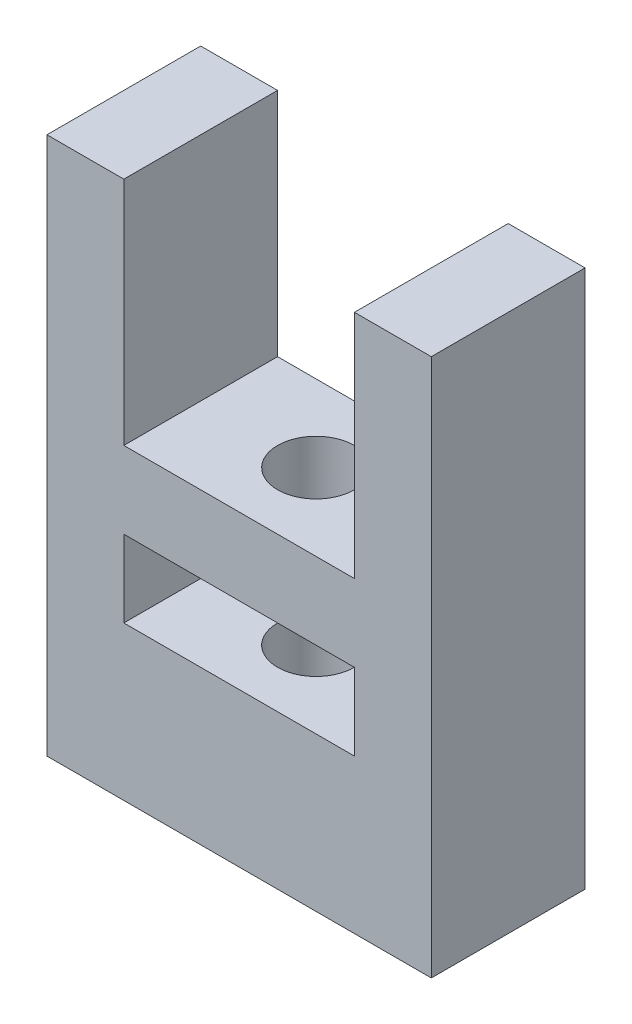
ISO-10303-21;
HEADER;
FILE_DESCRIPTION(('STEP AP214'),'2;1');
FILE_NAME('part.step','',(''),(''),'','','');
FILE_SCHEMA(('AUTOMOTIVE_DESIGN { 1 0 10303 214 1 1 1 1 }'));
ENDSEC;
DATA;
#1=APPLICATION_CONTEXT('core data for automotive mechanical design processes');
#2=APPLICATION_PROTOCOL_DEFINITION('international standard','automotive_design',2000,#1);
#3=PRODUCT_CONTEXT('',#1,'mechanical');
#4=PRODUCT('Part','Part','',(#3));
#5=PRODUCT_RELATED_PRODUCT_CATEGORY('part','',(#4));
#6=PRODUCT_DEFINITION_FORMATION('','',#4);
#7=PRODUCT_DEFINITION_CONTEXT('part definition',#1,'design');
#8=PRODUCT_DEFINITION('design','',#6,#7);
#9=PRODUCT_DEFINITION_SHAPE('','',#8);
#10=(LENGTH_UNIT() NAMED_UNIT(*) SI_UNIT(.MILLI.,.METRE.));
#11=(NAMED_UNIT(*) PLANE_ANGLE_UNIT() SI_UNIT($,.RADIAN.));
#12=(NAMED_UNIT(*) SI_UNIT($,.STERADIAN.) SOLID_ANGLE_UNIT());
#13=UNCERTAINTY_MEASURE_WITH_UNIT(LENGTH_MEASURE(1.E-05),#10,'distance_accuracy_value','');
#14=(GEOMETRIC_REPRESENTATION_CONTEXT(3) GLOBAL_UNCERTAINTY_ASSIGNED_CONTEXT((#13)) GLOBAL_UNIT_ASSIGNED_CONTEXT((#10,
#11,#12)) REPRESENTATION_CONTEXT('',''));
#15=CARTESIAN_POINT('',(0.,0.,0.));
#16=DIRECTION('',(0.,0.,1.));
#17=DIRECTION('',(1.,0.,0.));
#18=AXIS2_PLACEMENT_3D('',#15,#16,#17);
#19=CARTESIAN_POINT('',(0.,70.,20.));
#20=DIRECTION('',(0.,0.,1.));
#21=DIRECTION('',(1.,0.,0.));
#22=AXIS2_PLACEMENT_3D('',#19,#20,#21);
#23=PLANE('',#22);
#24=DIRECTION('',(0.,1.,0.));
#25=VECTOR('',#24,1.);
#26=CARTESIAN_POINT('',(0.,0.,20.));
#27=LINE('',#26,#25);
#28=CARTESIAN_POINT('',(0.,0.,20.));
#29=VERTEX_POINT('',#28);
#30=CARTESIAN_POINT('',(0.,70.,20.));
#31=VERTEX_POINT('',#30);
#32=EDGE_CURVE('E159',#29,#31,#27,.T.);
#33=ORIENTED_EDGE('',*,*,#32,.T.);
#34=DIRECTION('',(-1.,0.,0.));
#35=VECTOR('',#34,1.);
#36=CARTESIAN_POINT('',(0.,70.,20.));
#37=LINE('',#36,#35);
#38=CARTESIAN_POINT('',(-10.,70.,20.));
#39=VERTEX_POINT('',#38);
#40=EDGE_CURVE('E162',#31,#39,#37,.T.);
#41=ORIENTED_EDGE('',*,*,#40,.T.);
#42=DIRECTION('',(0.,-1.,0.));
#43=VECTOR('',#42,1.);
#44=CARTESIAN_POINT('',(-10.,70.,20.));
#45=LINE('',#44,#43);
#46=CARTESIAN_POINT('',(-10.,40.,20.));
#47=VERTEX_POINT('',#46);
#48=EDGE_CURVE('E165',#39,#47,#45,.T.);
#49=ORIENTED_EDGE('',*,*,#48,.T.);
#50=DIRECTION('',(-1.,0.,0.));
#51=VECTOR('',#50,1.);
#52=CARTESIAN_POINT('',(-40.,40.,20.));
#53=LINE('',#52,#51);
#54=CARTESIAN_POINT('',(-40.,40.,20.));
#55=VERTEX_POINT('',#54);
#56=EDGE_CURVE('E167',#47,#55,#53,.T.);
#57=ORIENTED_EDGE('',*,*,#56,.T.);
#58=DIRECTION('',(0.,1.,0.));
#59=VECTOR('',#58,1.);
#60=CARTESIAN_POINT('',(-40.,70.,20.));
#61=LINE('',#60,#59);
#62=CARTESIAN_POINT('',(-40.,70.,20.));
#63=VERTEX_POINT('',#62);
#64=EDGE_CURVE('E169',#55,#63,#61,.T.);
#65=ORIENTED_EDGE('',*,*,#64,.T.);
#66=DIRECTION('',(-1.,0.,0.));
#67=VECTOR('',#66,1.);
#68=CARTESIAN_POINT('',(-40.,70.,20.));
#69=LINE('',#68,#67);
#70=CARTESIAN_POINT('',(-50.,70.,20.));
#71=VERTEX_POINT('',#70);
#72=EDGE_CURVE('E171',#63,#71,#69,.T.);
#73=ORIENTED_EDGE('',*,*,#72,.T.);
#74=DIRECTION('',(0.,-1.,0.));
#75=VECTOR('',#74,1.);
#76=CARTESIAN_POINT('',(-50.,0.,20.));
#77=LINE('',#76,#75);
#78=CARTESIAN_POINT('',(-50.,0.,20.));
#79=VERTEX_POINT('',#78);
#80=EDGE_CURVE('E173',#71,#79,#77,.T.);
#81=ORIENTED_EDGE('',*,*,#80,.T.);
#82=DIRECTION('',(1.,0.,0.));
#83=VECTOR('',#82,1.);
#84=CARTESIAN_POINT('',(0.,0.,20.));
#85=LINE('',#84,#83);
#86=EDGE_CURVE('E175',#79,#29,#85,.T.);
#87=ORIENTED_EDGE('',*,*,#86,.T.);
#88=EDGE_LOOP('',(#33,#41,#49,#57,#65,#73,#81,#87));
#89=FACE_BOUND('',#88,.T.);
#90=DIRECTION('',(1.,0.,0.));
#91=VECTOR('',#90,1.);
#92=CARTESIAN_POINT('',(-40.,20.,20.));
#93=LINE('',#92,#91);
#94=CARTESIAN_POINT('',(-40.,20.,20.));
#95=VERTEX_POINT('',#94);
#96=CARTESIAN_POINT('',(-10.,20.,20.));
#97=VERTEX_POINT('',#96);
#98=EDGE_CURVE('E129',#95,#97,#93,.T.);
#99=ORIENTED_EDGE('',*,*,#98,.F.);
#100=DIRECTION('',(0.,-1.,0.));
#101=VECTOR('',#100,1.);
#102=CARTESIAN_POINT('',(-40.,30.,20.));
#103=LINE('',#102,#101);
#104=CARTESIAN_POINT('',(-40.,30.,20.));
#105=VERTEX_POINT('',#104);
#106=EDGE_CURVE('E121',#105,#95,#103,.T.);
#107=ORIENTED_EDGE('',*,*,#106,.F.);
#108=DIRECTION('',(-1.,0.,0.));
#109=VECTOR('',#108,1.);
#110=CARTESIAN_POINT('',(-40.,30.,20.));
#111=LINE('',#110,#109);
#112=CARTESIAN_POINT('',(-10.,30.,20.));
#113=VERTEX_POINT('',#112);
#114=EDGE_CURVE('E143',#113,#105,#111,.T.);
#115=ORIENTED_EDGE('',*,*,#114,.F.);
#116=DIRECTION('',(0.,1.,0.));
#117=VECTOR('',#116,1.);
#118=CARTESIAN_POINT('',(-10.,30.,20.));
#119=LINE('',#118,#117);
#120=EDGE_CURVE('E141',#97,#113,#119,.T.);
#121=ORIENTED_EDGE('',*,*,#120,.F.);
#122=EDGE_LOOP('',(#99,#107,#115,#121));
#123=FACE_BOUND('',#122,.T.);
#124=ADVANCED_FACE('F31',(#89,#123),#23,.T.);
#125=CARTESIAN_POINT('',(0.,70.,0.));
#126=DIRECTION('',(0.,0.,1.));
#127=DIRECTION('',(1.,0.,0.));
#128=AXIS2_PLACEMENT_3D('',#125,#126,#127);
#129=PLANE('',#128);
#130=DIRECTION('',(0.,1.,0.));
#131=VECTOR('',#130,1.);
#132=CARTESIAN_POINT('',(0.,0.,0.));
#133=LINE('',#132,#131);
#134=CARTESIAN_POINT('',(0.,0.,0.));
#135=VERTEX_POINT('',#134);
#136=CARTESIAN_POINT('',(0.,70.,0.));
#137=VERTEX_POINT('',#136);
#138=EDGE_CURVE('E137',#135,#137,#133,.T.);
#139=ORIENTED_EDGE('',*,*,#138,.F.);
#140=DIRECTION('',(1.,0.,0.));
#141=VECTOR('',#140,1.);
#142=CARTESIAN_POINT('',(0.,0.,0.));
#143=LINE('',#142,#141);
#144=CARTESIAN_POINT('',(-50.,0.,0.));
#145=VERTEX_POINT('',#144);
#146=EDGE_CURVE('E163',#145,#135,#143,.T.);
#147=ORIENTED_EDGE('',*,*,#146,.F.);
#148=DIRECTION('',(0.,-1.,0.));
#149=VECTOR('',#148,1.);
#150=CARTESIAN_POINT('',(-50.,0.,0.));
#151=LINE('',#150,#149);
#152=CARTESIAN_POINT('',(-50.,70.,0.));
#153=VERTEX_POINT('',#152);
#154=EDGE_CURVE('E190',#153,#145,#151,.T.);
#155=ORIENTED_EDGE('',*,*,#154,.F.);
#156=DIRECTION('',(-1.,0.,0.));
#157=VECTOR('',#156,1.);
#158=CARTESIAN_POINT('',(-40.,70.,0.));
#159=LINE('',#158,#157);
#160=CARTESIAN_POINT('',(-40.,70.,0.));
#161=VERTEX_POINT('',#160);
#162=EDGE_CURVE('E188',#161,#153,#159,.T.);
#163=ORIENTED_EDGE('',*,*,#162,.F.);
#164=DIRECTION('',(0.,1.,0.));
#165=VECTOR('',#164,1.);
#166=CARTESIAN_POINT('',(-40.,70.,0.));
#167=LINE('',#166,#165);
#168=CARTESIAN_POINT('',(-40.,40.,0.));
#169=VERTEX_POINT('',#168);
#170=EDGE_CURVE('E186',#169,#161,#167,.T.);
#171=ORIENTED_EDGE('',*,*,#170,.F.);
#172=DIRECTION('',(-1.,0.,0.));
#173=VECTOR('',#172,1.);
#174=CARTESIAN_POINT('',(-40.,40.,0.));
#175=LINE('',#174,#173);
#176=CARTESIAN_POINT('',(-10.,40.,0.));
#177=VERTEX_POINT('',#176);
#178=EDGE_CURVE('E184',#177,#169,#175,.T.);
#179=ORIENTED_EDGE('',*,*,#178,.F.);
#180=DIRECTION('',(0.,-1.,0.));
#181=VECTOR('',#180,1.);
#182=CARTESIAN_POINT('',(-10.,70.,0.));
#183=LINE('',#182,#181);
#184=CARTESIAN_POINT('',(-10.,70.,0.));
#185=VERTEX_POINT('',#184);
#186=EDGE_CURVE('E182',#185,#177,#183,.T.);
#187=ORIENTED_EDGE('',*,*,#186,.F.);
#188=DIRECTION('',(-1.,0.,0.));
#189=VECTOR('',#188,1.);
#190=CARTESIAN_POINT('',(0.,70.,0.));
#191=LINE('',#190,#189);
#192=EDGE_CURVE('E180',#137,#185,#191,.T.);
#193=ORIENTED_EDGE('',*,*,#192,.F.);
#194=EDGE_LOOP('',(#139,#147,#155,#163,#171,#179,#187,#193));
#195=FACE_BOUND('',#194,.T.);
#196=DIRECTION('',(0.,-1.,0.));
#197=VECTOR('',#196,1.);
#198=CARTESIAN_POINT('',(-40.,30.,0.));
#199=LINE('',#198,#197);
#200=CARTESIAN_POINT('',(-40.,30.,0.));
#201=VERTEX_POINT('',#200);
#202=CARTESIAN_POINT('',(-40.,20.,0.));
#203=VERTEX_POINT('',#202);
#204=EDGE_CURVE('E55',#201,#203,#199,.T.);
#205=ORIENTED_EDGE('',*,*,#204,.T.);
#206=DIRECTION('',(1.,0.,0.));
#207=VECTOR('',#206,1.);
#208=CARTESIAN_POINT('',(-40.,20.,0.));
#209=LINE('',#208,#207);
#210=CARTESIAN_POINT('',(-10.,20.,0.));
#211=VERTEX_POINT('',#210);
#212=EDGE_CURVE('E136',#203,#211,#209,.T.);
#213=ORIENTED_EDGE('',*,*,#212,.T.);
#214=DIRECTION('',(0.,1.,0.));
#215=VECTOR('',#214,1.);
#216=CARTESIAN_POINT('',(-10.,30.,0.));
#217=LINE('',#216,#215);
#218=CARTESIAN_POINT('',(-10.,30.,0.));
#219=VERTEX_POINT('',#218);
#220=EDGE_CURVE('E151',#211,#219,#217,.T.);
#221=ORIENTED_EDGE('',*,*,#220,.T.);
#222=DIRECTION('',(-1.,0.,0.));
#223=VECTOR('',#222,1.);
#224=CARTESIAN_POINT('',(-40.,30.,0.));
#225=LINE('',#224,#223);
#226=EDGE_CURVE('E130',#219,#201,#225,.T.);
#227=ORIENTED_EDGE('',*,*,#226,.T.);
#228=EDGE_LOOP('',(#205,#213,#221,#227));
#229=FACE_BOUND('',#228,.T.);
#230=ADVANCED_FACE('F221',(#195,#229),#129,.F.);
#231=CARTESIAN_POINT('',(0.,0.,20.));
#232=DIRECTION('',(-1.,0.,0.));
#233=DIRECTION('',(0.,0.,1.));
#234=AXIS2_PLACEMENT_3D('',#231,#232,#233);
#235=PLANE('',#234);
#236=ORIENTED_EDGE('',*,*,#138,.T.);
#237=DIRECTION('',(0.,0.,-1.));
#238=VECTOR('',#237,1.);
#239=CARTESIAN_POINT('',(0.,70.,20.));
#240=LINE('',#239,#238);
#241=EDGE_CURVE('E11',#31,#137,#240,.T.);
#242=ORIENTED_EDGE('',*,*,#241,.F.);
#243=ORIENTED_EDGE('',*,*,#32,.F.);
#244=DIRECTION('',(0.,0.,-1.));
#245=VECTOR('',#244,1.);
#246=CARTESIAN_POINT('',(0.,0.,20.));
#247=LINE('',#246,#245);
#248=EDGE_CURVE('E177',#29,#135,#247,.T.);
#249=ORIENTED_EDGE('',*,*,#248,.T.);
#250=EDGE_LOOP('',(#236,#242,#243,#249));
#251=FACE_BOUND('',#250,.T.);
#252=ADVANCED_FACE('F33',(#251),#235,.F.);
#253=CARTESIAN_POINT('',(0.,70.,20.));
#254=DIRECTION('',(0.,-1.,0.));
#255=DIRECTION('',(0.,0.,-1.));
#256=AXIS2_PLACEMENT_3D('',#253,#254,#255);
#257=PLANE('',#256);
#258=ORIENTED_EDGE('',*,*,#192,.T.);
#259=DIRECTION('',(0.,0.,-1.));
#260=VECTOR('',#259,1.);
#261=CARTESIAN_POINT('',(-10.,70.,20.));
#262=LINE('',#261,#260);
#263=EDGE_CURVE('E40',#39,#185,#262,.T.);
#264=ORIENTED_EDGE('',*,*,#263,.F.);
#265=ORIENTED_EDGE('',*,*,#40,.F.);
#266=ORIENTED_EDGE('',*,*,#241,.T.);
#267=EDGE_LOOP('',(#258,#264,#265,#266));
#268=FACE_BOUND('',#267,.T.);
#269=ADVANCED_FACE('F238',(#268),#257,.F.);
#270=CARTESIAN_POINT('',(-10.,70.,20.));
#271=DIRECTION('',(1.,0.,0.));
#272=DIRECTION('',(0.,1.,0.));
#273=AXIS2_PLACEMENT_3D('',#270,#271,#272);
#274=PLANE('',#273);
#275=ORIENTED_EDGE('',*,*,#186,.T.);
#276=DIRECTION('',(0.,0.,-1.));
#277=VECTOR('',#276,1.);
#278=CARTESIAN_POINT('',(-10.,40.,20.));
#279=LINE('',#278,#277);
#280=EDGE_CURVE('E207',#47,#177,#279,.T.);
#281=ORIENTED_EDGE('',*,*,#280,.F.);
#282=ORIENTED_EDGE('',*,*,#48,.F.);
#283=ORIENTED_EDGE('',*,*,#263,.T.);
#284=EDGE_LOOP('',(#275,#281,#282,#283));
#285=FACE_BOUND('',#284,.T.);
#286=ADVANCED_FACE('F215',(#285),#274,.F.);
#287=CARTESIAN_POINT('',(-40.,40.,20.));
#288=DIRECTION('',(0.,-1.,0.));
#289=DIRECTION('',(1.,0.,0.));
#290=AXIS2_PLACEMENT_3D('',#287,#288,#289);
#291=PLANE('',#290);
#292=CARTESIAN_POINT('',(-25.,40.,10.));
#293=DIRECTION('',(0.,1.,0.));
#294=DIRECTION('',(-1.,0.,0.));
#295=AXIS2_PLACEMENT_3D('',#292,#293,#294);
#296=CIRCLE('',#295,5.);
#297=CARTESIAN_POINT('',(-30.,40.,10.));
#298=VERTEX_POINT('',#297);
#299=EDGE_CURVE('E278',#298,#298,#296,.T.);
#300=ORIENTED_EDGE('',*,*,#299,.F.);
#301=EDGE_LOOP('',(#300));
#302=FACE_BOUND('',#301,.T.);
#303=ORIENTED_EDGE('',*,*,#178,.T.);
#304=DIRECTION('',(0.,0.,-1.));
#305=VECTOR('',#304,1.);
#306=CARTESIAN_POINT('',(-40.,40.,20.));
#307=LINE('',#306,#305);
#308=EDGE_CURVE('E204',#55,#169,#307,.T.);
#309=ORIENTED_EDGE('',*,*,#308,.F.);
#310=ORIENTED_EDGE('',*,*,#56,.F.);
#311=ORIENTED_EDGE('',*,*,#280,.T.);
#312=EDGE_LOOP('',(#303,#309,#310,#311));
#313=FACE_BOUND('',#312,.T.);
#314=ADVANCED_FACE('F227',(#302,#313),#291,.F.);
#315=CARTESIAN_POINT('',(-40.,70.,20.));
#316=DIRECTION('',(-1.,0.,0.));
#317=DIRECTION('',(0.,0.,1.));
#318=AXIS2_PLACEMENT_3D('',#315,#316,#317);
#319=PLANE('',#318);
#320=ORIENTED_EDGE('',*,*,#170,.T.);
#321=DIRECTION('',(0.,0.,-1.));
#322=VECTOR('',#321,1.);
#323=CARTESIAN_POINT('',(-40.,70.,20.));
#324=LINE('',#323,#322);
#325=EDGE_CURVE('E201',#63,#161,#324,.T.);
#326=ORIENTED_EDGE('',*,*,#325,.F.);
#327=ORIENTED_EDGE('',*,*,#64,.F.);
#328=ORIENTED_EDGE('',*,*,#308,.T.);
#329=EDGE_LOOP('',(#320,#326,#327,#328));
#330=FACE_BOUND('',#329,.T.);
#331=ADVANCED_FACE('F231',(#330),#319,.F.);
#332=CARTESIAN_POINT('',(-40.,70.,20.));
#333=DIRECTION('',(0.,-1.,0.));
#334=DIRECTION('',(0.,0.,-1.));
#335=AXIS2_PLACEMENT_3D('',#332,#333,#334);
#336=PLANE('',#335);
#337=ORIENTED_EDGE('',*,*,#162,.T.);
#338=DIRECTION('',(0.,0.,-1.));
#339=VECTOR('',#338,1.);
#340=CARTESIAN_POINT('',(-50.,70.,20.));
#341=LINE('',#340,#339);
#342=EDGE_CURVE('E198',#71,#153,#341,.T.);
#343=ORIENTED_EDGE('',*,*,#342,.F.);
#344=ORIENTED_EDGE('',*,*,#72,.F.);
#345=ORIENTED_EDGE('',*,*,#325,.T.);
#346=EDGE_LOOP('',(#337,#343,#344,#345));
#347=FACE_BOUND('',#346,.T.);
#348=ADVANCED_FACE('F251',(#347),#336,.F.);
#349=CARTESIAN_POINT('',(-50.,0.,20.));
#350=DIRECTION('',(1.,0.,0.));
#351=DIRECTION('',(0.,0.,-1.));
#352=AXIS2_PLACEMENT_3D('',#349,#350,#351);
#353=PLANE('',#352);
#354=ORIENTED_EDGE('',*,*,#154,.T.);
#355=DIRECTION('',(0.,0.,-1.));
#356=VECTOR('',#355,1.);
#357=CARTESIAN_POINT('',(-50.,0.,20.));
#358=LINE('',#357,#356);
#359=EDGE_CURVE('E195',#79,#145,#358,.T.);
#360=ORIENTED_EDGE('',*,*,#359,.F.);
#361=ORIENTED_EDGE('',*,*,#80,.F.);
#362=ORIENTED_EDGE('',*,*,#342,.T.);
#363=EDGE_LOOP('',(#354,#360,#361,#362));
#364=FACE_BOUND('',#363,.T.);
#365=ADVANCED_FACE('F249',(#364),#353,.F.);
#366=CARTESIAN_POINT('',(0.,0.,20.));
#367=DIRECTION('',(0.,1.,0.));
#368=DIRECTION('',(-1.,0.,0.));
#369=AXIS2_PLACEMENT_3D('',#366,#367,#368);
#370=PLANE('',#369);
#371=CARTESIAN_POINT('',(-25.,0.,10.));
#372=DIRECTION('',(0.,1.,0.));
#373=DIRECTION('',(-1.,0.,0.));
#374=AXIS2_PLACEMENT_3D('',#371,#372,#373);
#375=CIRCLE('',#374,5.);
#376=CARTESIAN_POINT('',(-30.,0.,10.));
#377=VERTEX_POINT('',#376);
#378=EDGE_CURVE('E276',#377,#377,#375,.T.);
#379=ORIENTED_EDGE('',*,*,#378,.T.);
#380=EDGE_LOOP('',(#379));
#381=FACE_BOUND('',#380,.T.);
#382=ORIENTED_EDGE('',*,*,#146,.T.);
#383=ORIENTED_EDGE('',*,*,#248,.F.);
#384=ORIENTED_EDGE('',*,*,#86,.F.);
#385=ORIENTED_EDGE('',*,*,#359,.T.);
#386=EDGE_LOOP('',(#382,#383,#384,#385));
#387=FACE_BOUND('',#386,.T.);
#388=ADVANCED_FACE('F244',(#381,#387),#370,.F.);
#389=CARTESIAN_POINT('',(-40.,30.,20.));
#390=DIRECTION('',(1.,0.,0.));
#391=DIRECTION('',(0.,0.,-1.));
#392=AXIS2_PLACEMENT_3D('',#389,#390,#391);
#393=PLANE('',#392);
#394=ORIENTED_EDGE('',*,*,#204,.F.);
#395=DIRECTION('',(0.,0.,-1.));
#396=VECTOR('',#395,1.);
#397=CARTESIAN_POINT('',(-40.,30.,20.));
#398=LINE('',#397,#396);
#399=EDGE_CURVE('E125',#105,#201,#398,.T.);
#400=ORIENTED_EDGE('',*,*,#399,.F.);
#401=ORIENTED_EDGE('',*,*,#106,.T.);
#402=DIRECTION('',(0.,0.,-1.));
#403=VECTOR('',#402,1.);
#404=CARTESIAN_POINT('',(-40.,20.,20.));
#405=LINE('',#404,#403);
#406=EDGE_CURVE('E124',#95,#203,#405,.T.);
#407=ORIENTED_EDGE('',*,*,#406,.T.);
#408=EDGE_LOOP('',(#394,#400,#401,#407));
#409=FACE_BOUND('',#408,.T.);
#410=ADVANCED_FACE('F123',(#409),#393,.T.);
#411=CARTESIAN_POINT('',(-40.,20.,20.));
#412=DIRECTION('',(0.,1.,0.));
#413=DIRECTION('',(0.,0.,1.));
#414=AXIS2_PLACEMENT_3D('',#411,#412,#413);
#415=PLANE('',#414);
#416=CARTESIAN_POINT('',(-25.,20.,10.));
#417=DIRECTION('',(0.,1.,0.));
#418=DIRECTION('',(0.,0.,1.));
#419=AXIS2_PLACEMENT_3D('',#416,#417,#418);
#420=CIRCLE('',#419,5.);
#421=CARTESIAN_POINT('',(-25.,20.,15.));
#422=VERTEX_POINT('',#421);
#423=EDGE_CURVE('E149',#422,#422,#420,.T.);
#424=ORIENTED_EDGE('',*,*,#423,.F.);
#425=EDGE_LOOP('',(#424));
#426=FACE_BOUND('',#425,.T.);
#427=ORIENTED_EDGE('',*,*,#212,.F.);
#428=ORIENTED_EDGE('',*,*,#406,.F.);
#429=ORIENTED_EDGE('',*,*,#98,.T.);
#430=DIRECTION('',(0.,0.,-1.));
#431=VECTOR('',#430,1.);
#432=CARTESIAN_POINT('',(-10.,20.,20.));
#433=LINE('',#432,#431);
#434=EDGE_CURVE('E138',#97,#211,#433,.T.);
#435=ORIENTED_EDGE('',*,*,#434,.T.);
#436=EDGE_LOOP('',(#427,#428,#429,#435));
#437=FACE_BOUND('',#436,.T.);
#438=ADVANCED_FACE('F133',(#426,#437),#415,.T.);
#439=CARTESIAN_POINT('',(-10.,30.,20.));
#440=DIRECTION('',(-1.,0.,0.));
#441=DIRECTION('',(0.,0.,1.));
#442=AXIS2_PLACEMENT_3D('',#439,#440,#441);
#443=PLANE('',#442);
#444=ORIENTED_EDGE('',*,*,#220,.F.);
#445=ORIENTED_EDGE('',*,*,#434,.F.);
#446=ORIENTED_EDGE('',*,*,#120,.T.);
#447=DIRECTION('',(0.,0.,-1.));
#448=VECTOR('',#447,1.);
#449=CARTESIAN_POINT('',(-10.,30.,20.));
#450=LINE('',#449,#448);
#451=EDGE_CURVE('E47',#113,#219,#450,.T.);
#452=ORIENTED_EDGE('',*,*,#451,.T.);
#453=EDGE_LOOP('',(#444,#445,#446,#452));
#454=FACE_BOUND('',#453,.T.);
#455=ADVANCED_FACE('F289',(#454),#443,.T.);
#456=CARTESIAN_POINT('',(-40.,30.,20.));
#457=DIRECTION('',(0.,-1.,0.));
#458=DIRECTION('',(0.,0.,-1.));
#459=AXIS2_PLACEMENT_3D('',#456,#457,#458);
#460=PLANE('',#459);
#461=CARTESIAN_POINT('',(-25.,30.,10.));
#462=DIRECTION('',(0.,-1.,0.));
#463=DIRECTION('',(0.,0.,-1.));
#464=AXIS2_PLACEMENT_3D('',#461,#462,#463);
#465=CIRCLE('',#464,5.);
#466=CARTESIAN_POINT('',(-25.,30.,5.));
#467=VERTEX_POINT('',#466);
#468=EDGE_CURVE('E35',#467,#467,#465,.T.);
#469=ORIENTED_EDGE('',*,*,#468,.F.);
#470=EDGE_LOOP('',(#469));
#471=FACE_BOUND('',#470,.T.);
#472=ORIENTED_EDGE('',*,*,#226,.F.);
#473=ORIENTED_EDGE('',*,*,#451,.F.);
#474=ORIENTED_EDGE('',*,*,#114,.T.);
#475=ORIENTED_EDGE('',*,*,#399,.T.);
#476=EDGE_LOOP('',(#472,#473,#474,#475));
#477=FACE_BOUND('',#476,.T.);
#478=ADVANCED_FACE('F293',(#471,#477),#460,.T.);
#479=CARTESIAN_POINT('',(-25.,0.,10.));
#480=DIRECTION('',(0.,1.,0.));
#481=DIRECTION('',(-1.,0.,0.));
#482=AXIS2_PLACEMENT_3D('',#479,#480,#481);
#483=CYLINDRICAL_SURFACE('',#482,5.);
#484=ORIENTED_EDGE('',*,*,#468,.T.);
#485=EDGE_LOOP('',(#484));
#486=FACE_BOUND('',#485,.T.);
#487=ORIENTED_EDGE('',*,*,#299,.T.);
#488=EDGE_LOOP('',(#487));
#489=FACE_BOUND('',#488,.T.);
#490=ADVANCED_FACE('F299',(#486,#489),#483,.F.);
#491=ORIENTED_EDGE('',*,*,#423,.T.);
#492=EDGE_LOOP('',(#491));
#493=FACE_BOUND('',#492,.T.);
#494=ORIENTED_EDGE('',*,*,#378,.F.);
#495=EDGE_LOOP('',(#494));
#496=FACE_BOUND('',#495,.T.);
#497=ADVANCED_FACE('F286',(#493,#496),#483,.F.);
#498=CLOSED_SHELL('',(#124,#230,#252,#269,#286,#314,#331,#348,#365,#388,#410,#438,#455,#478,
#490,#497));
#499=MANIFOLD_SOLID_BREP('B2',#498);
#500=ADVANCED_BREP_SHAPE_REPRESENTATION('',(#18,#499),#14);
#501=SHAPE_DEFINITION_REPRESENTATION(#9,#500);
ENDSEC;
END-ISO-10303-21;
